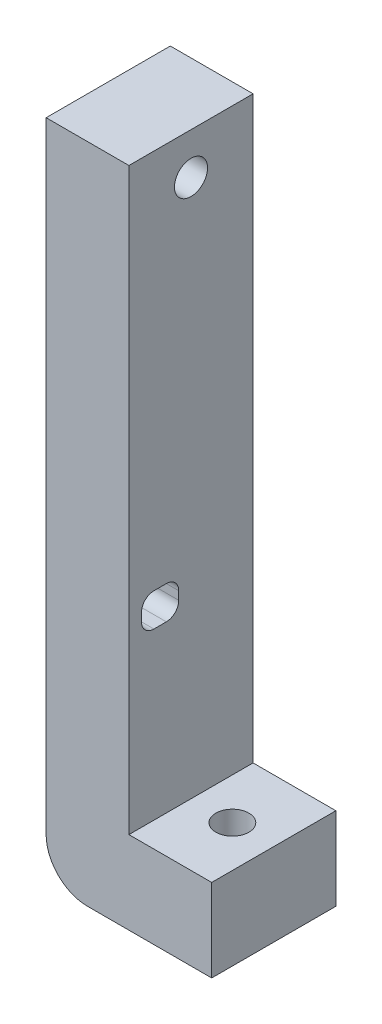
ISO-10303-21;
HEADER;
FILE_DESCRIPTION(('STEP AP214'),'2;1');
FILE_NAME('part.step','',(''),(''),'','','');
FILE_SCHEMA(('AUTOMOTIVE_DESIGN { 1 0 10303 214 1 1 1 1 }'));
ENDSEC;
DATA;
#1=APPLICATION_CONTEXT('core data for automotive mechanical design processes');
#2=APPLICATION_PROTOCOL_DEFINITION('international standard','automotive_design',2000,#1);
#3=PRODUCT_CONTEXT('',#1,'mechanical');
#4=PRODUCT('Part','Part','',(#3));
#5=PRODUCT_RELATED_PRODUCT_CATEGORY('part','',(#4));
#6=PRODUCT_DEFINITION_FORMATION('','',#4);
#7=PRODUCT_DEFINITION_CONTEXT('part definition',#1,'design');
#8=PRODUCT_DEFINITION('design','',#6,#7);
#9=PRODUCT_DEFINITION_SHAPE('','',#8);
#10=(LENGTH_UNIT() NAMED_UNIT(*) SI_UNIT(.MILLI.,.METRE.));
#11=(NAMED_UNIT(*) PLANE_ANGLE_UNIT() SI_UNIT($,.RADIAN.));
#12=(NAMED_UNIT(*) SI_UNIT($,.STERADIAN.) SOLID_ANGLE_UNIT());
#13=UNCERTAINTY_MEASURE_WITH_UNIT(LENGTH_MEASURE(1.E-05),#10,'distance_accuracy_value','');
#14=(GEOMETRIC_REPRESENTATION_CONTEXT(3) GLOBAL_UNCERTAINTY_ASSIGNED_CONTEXT((#13)) GLOBAL_UNIT_ASSIGNED_CONTEXT((#10,
#11,#12)) REPRESENTATION_CONTEXT('',''));
#15=CARTESIAN_POINT('',(0.,0.,0.));
#16=DIRECTION('',(0.,0.,1.));
#17=DIRECTION('',(1.,0.,0.));
#18=AXIS2_PLACEMENT_3D('',#15,#16,#17);
#19=CARTESIAN_POINT('',(-10.,-20.,15.));
#20=DIRECTION('',(1.,0.,0.));
#21=DIRECTION('',(0.,0.,-1.));
#22=AXIS2_PLACEMENT_3D('',#19,#20,#21);
#23=PLANE('',#22);
#24=CARTESIAN_POINT('',(-10.,55.,7.49999999999999));
#25=DIRECTION('',(-1.,0.,0.));
#26=DIRECTION('',(0.,0.,1.));
#27=AXIS2_PLACEMENT_3D('',#24,#25,#26);
#28=CIRCLE('',#27,2.);
#29=CARTESIAN_POINT('',(-10.,55.,9.49999999999999));
#30=VERTEX_POINT('',#29);
#31=EDGE_CURVE('E176',#30,#30,#28,.T.);
#32=ORIENTED_EDGE('',*,*,#31,.F.);
#33=EDGE_LOOP('',(#32));
#34=FACE_BOUND('',#33,.T.);
#35=DIRECTION('',(0.,0.,1.));
#36=VECTOR('',#35,1.);
#37=CARTESIAN_POINT('',(-10.,14.,11.98));
#38=LINE('',#37,#36);
#39=CARTESIAN_POINT('',(-10.,14.,10.48));
#40=VERTEX_POINT('',#39);
#41=CARTESIAN_POINT('',(-10.,14.,11.98));
#42=VERTEX_POINT('',#41);
#43=EDGE_CURVE('E160',#40,#42,#38,.T.);
#44=ORIENTED_EDGE('',*,*,#43,.T.);
#45=CARTESIAN_POINT('',(-10.,12.5,11.98));
#46=DIRECTION('',(1.,0.,0.));
#47=DIRECTION('',(0.,-1.,0.));
#48=AXIS2_PLACEMENT_3D('',#45,#46,#47);
#49=CIRCLE('',#48,1.5);
#50=CARTESIAN_POINT('',(-10.,12.5,13.48));
#51=VERTEX_POINT('',#50);
#52=EDGE_CURVE('E154',#42,#51,#49,.T.);
#53=ORIENTED_EDGE('',*,*,#52,.T.);
#54=DIRECTION('',(0.,-1.,0.));
#55=VECTOR('',#54,1.);
#56=CARTESIAN_POINT('',(-10.,11.5,13.48));
#57=LINE('',#56,#55);
#58=CARTESIAN_POINT('',(-10.,11.5,13.48));
#59=VERTEX_POINT('',#58);
#60=EDGE_CURVE('E163',#51,#59,#57,.T.);
#61=ORIENTED_EDGE('',*,*,#60,.T.);
#62=CARTESIAN_POINT('',(-10.,11.5,11.98));
#63=DIRECTION('',(1.,0.,0.));
#64=DIRECTION('',(0.,1.,0.));
#65=AXIS2_PLACEMENT_3D('',#62,#63,#64);
#66=CIRCLE('',#65,1.5);
#67=CARTESIAN_POINT('',(-10.,10.,11.98));
#68=VERTEX_POINT('',#67);
#69=EDGE_CURVE('E61',#59,#68,#66,.T.);
#70=ORIENTED_EDGE('',*,*,#69,.T.);
#71=DIRECTION('',(0.,0.,-1.));
#72=VECTOR('',#71,1.);
#73=CARTESIAN_POINT('',(-10.,10.,10.48));
#74=LINE('',#73,#72);
#75=CARTESIAN_POINT('',(-10.,10.,10.48));
#76=VERTEX_POINT('',#75);
#77=EDGE_CURVE('E179',#68,#76,#74,.T.);
#78=ORIENTED_EDGE('',*,*,#77,.T.);
#79=CARTESIAN_POINT('',(-10.,11.5,10.48));
#80=DIRECTION('',(1.,0.,0.));
#81=DIRECTION('',(0.,-1.,0.));
#82=AXIS2_PLACEMENT_3D('',#79,#80,#81);
#83=CIRCLE('',#82,1.5);
#84=CARTESIAN_POINT('',(-10.,11.5,8.98));
#85=VERTEX_POINT('',#84);
#86=EDGE_CURVE('E182',#76,#85,#83,.T.);
#87=ORIENTED_EDGE('',*,*,#86,.T.);
#88=DIRECTION('',(0.,1.,0.));
#89=VECTOR('',#88,1.);
#90=CARTESIAN_POINT('',(-10.,12.5,8.98));
#91=LINE('',#90,#89);
#92=CARTESIAN_POINT('',(-10.,12.5,8.98));
#93=VERTEX_POINT('',#92);
#94=EDGE_CURVE('E185',#85,#93,#91,.T.);
#95=ORIENTED_EDGE('',*,*,#94,.T.);
#96=CARTESIAN_POINT('',(-10.,12.5,10.48));
#97=DIRECTION('',(1.,0.,0.));
#98=DIRECTION('',(0.,-1.,0.));
#99=AXIS2_PLACEMENT_3D('',#96,#97,#98);
#100=CIRCLE('',#99,1.5);
#101=EDGE_CURVE('E188',#93,#40,#100,.T.);
#102=ORIENTED_EDGE('',*,*,#101,.T.);
#103=EDGE_LOOP('',(#44,#53,#61,#70,#78,#87,#95,#102));
#104=FACE_BOUND('',#103,.T.);
#105=DIRECTION('',(0.,-1.,0.));
#106=VECTOR('',#105,1.);
#107=CARTESIAN_POINT('',(-10.,-20.,0.));
#108=LINE('',#107,#106);
#109=CARTESIAN_POINT('',(-10.,60.,0.));
#110=VERTEX_POINT('',#109);
#111=CARTESIAN_POINT('',(-10.,-15.,0.));
#112=VERTEX_POINT('',#111);
#113=EDGE_CURVE('E237',#110,#112,#108,.T.);
#114=ORIENTED_EDGE('',*,*,#113,.T.);
#115=DIRECTION('',(0.,0.,-1.));
#116=VECTOR('',#115,1.);
#117=CARTESIAN_POINT('',(-10.,-15.,15.));
#118=LINE('',#117,#116);
#119=CARTESIAN_POINT('',(-10.,-15.,15.));
#120=VERTEX_POINT('',#119);
#121=EDGE_CURVE('E53',#112,#120,#118,.F.);
#122=ORIENTED_EDGE('',*,*,#121,.T.);
#123=DIRECTION('',(0.,-1.,0.));
#124=VECTOR('',#123,1.);
#125=CARTESIAN_POINT('',(-10.,-20.,15.));
#126=LINE('',#125,#124);
#127=CARTESIAN_POINT('',(-10.,60.,15.));
#128=VERTEX_POINT('',#127);
#129=EDGE_CURVE('E238',#128,#120,#126,.T.);
#130=ORIENTED_EDGE('',*,*,#129,.F.);
#131=DIRECTION('',(0.,0.,1.));
#132=VECTOR('',#131,1.);
#133=CARTESIAN_POINT('',(-10.,60.,0.));
#134=LINE('',#133,#132);
#135=EDGE_CURVE('E231',#110,#128,#134,.T.);
#136=ORIENTED_EDGE('',*,*,#135,.F.);
#137=EDGE_LOOP('',(#114,#122,#130,#136));
#138=FACE_BOUND('',#137,.T.);
#139=ADVANCED_FACE('F44',(#34,#104,#138),#23,.F.);
#140=CARTESIAN_POINT('',(-10.,-20.,15.));
#141=DIRECTION('',(0.,1.,0.));
#142=DIRECTION('',(0.,0.,1.));
#143=AXIS2_PLACEMENT_3D('',#140,#141,#142);
#144=PLANE('',#143);
#145=CARTESIAN_POINT('',(5.,-20.,7.5));
#146=DIRECTION('',(0.,-1.,0.));
#147=DIRECTION('',(0.,0.,-1.));
#148=AXIS2_PLACEMENT_3D('',#145,#146,#147);
#149=CIRCLE('',#148,2.);
#150=CARTESIAN_POINT('',(5.,-20.,5.5));
#151=VERTEX_POINT('',#150);
#152=EDGE_CURVE('E210',#151,#151,#149,.T.);
#153=ORIENTED_EDGE('',*,*,#152,.F.);
#154=EDGE_LOOP('',(#153));
#155=FACE_BOUND('',#154,.T.);
#156=DIRECTION('',(1.,0.,0.));
#157=VECTOR('',#156,1.);
#158=CARTESIAN_POINT('',(-10.,-20.,15.));
#159=LINE('',#158,#157);
#160=CARTESIAN_POINT('',(-5.,-20.,15.));
#161=VERTEX_POINT('',#160);
#162=CARTESIAN_POINT('',(10.,-20.,15.));
#163=VERTEX_POINT('',#162);
#164=EDGE_CURVE('E241',#161,#163,#159,.T.);
#165=ORIENTED_EDGE('',*,*,#164,.F.);
#166=DIRECTION('',(0.,0.,-1.));
#167=VECTOR('',#166,1.);
#168=CARTESIAN_POINT('',(-5.,-20.,15.));
#169=LINE('',#168,#167);
#170=CARTESIAN_POINT('',(-5.,-20.,0.));
#171=VERTEX_POINT('',#170);
#172=EDGE_CURVE('E268',#161,#171,#169,.T.);
#173=ORIENTED_EDGE('',*,*,#172,.T.);
#174=DIRECTION('',(1.,0.,0.));
#175=VECTOR('',#174,1.);
#176=CARTESIAN_POINT('',(-10.,-20.,0.));
#177=LINE('',#176,#175);
#178=CARTESIAN_POINT('',(10.,-20.,0.));
#179=VERTEX_POINT('',#178);
#180=EDGE_CURVE('E253',#171,#179,#177,.T.);
#181=ORIENTED_EDGE('',*,*,#180,.T.);
#182=DIRECTION('',(0.,0.,-1.));
#183=VECTOR('',#182,1.);
#184=CARTESIAN_POINT('',(10.,-20.,15.));
#185=LINE('',#184,#183);
#186=EDGE_CURVE('E265',#163,#179,#185,.T.);
#187=ORIENTED_EDGE('',*,*,#186,.F.);
#188=EDGE_LOOP('',(#165,#173,#181,#187));
#189=FACE_BOUND('',#188,.T.);
#190=ADVANCED_FACE('F293',(#155,#189),#144,.F.);
#191=CARTESIAN_POINT('',(10.,-20.,15.));
#192=DIRECTION('',(-1.,0.,0.));
#193=DIRECTION('',(0.,-1.,0.));
#194=AXIS2_PLACEMENT_3D('',#191,#192,#193);
#195=PLANE('',#194);
#196=DIRECTION('',(0.,1.,0.));
#197=VECTOR('',#196,1.);
#198=CARTESIAN_POINT('',(10.,-20.,0.));
#199=LINE('',#198,#197);
#200=CARTESIAN_POINT('',(10.,-10.,0.));
#201=VERTEX_POINT('',#200);
#202=EDGE_CURVE('E255',#179,#201,#199,.T.);
#203=ORIENTED_EDGE('',*,*,#202,.T.);
#204=DIRECTION('',(0.,0.,-1.));
#205=VECTOR('',#204,1.);
#206=CARTESIAN_POINT('',(10.,-10.,15.));
#207=LINE('',#206,#205);
#208=CARTESIAN_POINT('',(10.,-10.,15.));
#209=VERTEX_POINT('',#208);
#210=EDGE_CURVE('E262',#209,#201,#207,.T.);
#211=ORIENTED_EDGE('',*,*,#210,.F.);
#212=DIRECTION('',(0.,1.,0.));
#213=VECTOR('',#212,1.);
#214=CARTESIAN_POINT('',(10.,-20.,15.));
#215=LINE('',#214,#213);
#216=EDGE_CURVE('E244',#163,#209,#215,.T.);
#217=ORIENTED_EDGE('',*,*,#216,.F.);
#218=ORIENTED_EDGE('',*,*,#186,.T.);
#219=EDGE_LOOP('',(#203,#211,#217,#218));
#220=FACE_BOUND('',#219,.T.);
#221=ADVANCED_FACE('F298',(#220),#195,.F.);
#222=CARTESIAN_POINT('',(0.,-10.,15.));
#223=DIRECTION('',(0.,-1.,0.));
#224=DIRECTION('',(0.,0.,-1.));
#225=AXIS2_PLACEMENT_3D('',#222,#223,#224);
#226=PLANE('',#225);
#227=CARTESIAN_POINT('',(5.,-9.99999999999999,7.5));
#228=DIRECTION('',(0.,-1.,0.));
#229=DIRECTION('',(0.,0.,-1.));
#230=AXIS2_PLACEMENT_3D('',#227,#228,#229);
#231=CIRCLE('',#230,2.);
#232=CARTESIAN_POINT('',(5.,-9.99999999999999,5.5));
#233=VERTEX_POINT('',#232);
#234=EDGE_CURVE('E224',#233,#233,#231,.T.);
#235=ORIENTED_EDGE('',*,*,#234,.T.);
#236=EDGE_LOOP('',(#235));
#237=FACE_BOUND('',#236,.T.);
#238=DIRECTION('',(-1.,0.,0.));
#239=VECTOR('',#238,1.);
#240=CARTESIAN_POINT('',(0.,-10.,0.));
#241=LINE('',#240,#239);
#242=CARTESIAN_POINT('',(0.,-10.,0.));
#243=VERTEX_POINT('',#242);
#244=EDGE_CURVE('E257',#201,#243,#241,.T.);
#245=ORIENTED_EDGE('',*,*,#244,.T.);
#246=DIRECTION('',(0.,0.,-1.));
#247=VECTOR('',#246,1.);
#248=CARTESIAN_POINT('',(0.,-10.,15.));
#249=LINE('',#248,#247);
#250=CARTESIAN_POINT('',(0.,-10.,15.));
#251=VERTEX_POINT('',#250);
#252=EDGE_CURVE('E250',#251,#243,#249,.T.);
#253=ORIENTED_EDGE('',*,*,#252,.F.);
#254=DIRECTION('',(-1.,0.,0.));
#255=VECTOR('',#254,1.);
#256=CARTESIAN_POINT('',(0.,-10.,15.));
#257=LINE('',#256,#255);
#258=EDGE_CURVE('E246',#209,#251,#257,.T.);
#259=ORIENTED_EDGE('',*,*,#258,.F.);
#260=ORIENTED_EDGE('',*,*,#210,.T.);
#261=EDGE_LOOP('',(#245,#253,#259,#260));
#262=FACE_BOUND('',#261,.T.);
#263=ADVANCED_FACE('F276',(#237,#262),#226,.F.);
#264=CARTESIAN_POINT('',(0.,20.,15.));
#265=DIRECTION('',(-1.,0.,0.));
#266=DIRECTION('',(0.,-1.,0.));
#267=AXIS2_PLACEMENT_3D('',#264,#265,#266);
#268=PLANE('',#267);
#269=CARTESIAN_POINT('',(0.,55.,7.49999999999999));
#270=DIRECTION('',(-1.,0.,0.));
#271=DIRECTION('',(0.,-1.,0.));
#272=AXIS2_PLACEMENT_3D('',#269,#270,#271);
#273=CIRCLE('',#272,2.);
#274=CARTESIAN_POINT('',(0.,53.,7.49999999999999));
#275=VERTEX_POINT('',#274);
#276=EDGE_CURVE('E48',#275,#275,#273,.T.);
#277=ORIENTED_EDGE('',*,*,#276,.T.);
#278=EDGE_LOOP('',(#277));
#279=FACE_BOUND('',#278,.T.);
#280=DIRECTION('',(0.,-1.,0.));
#281=VECTOR('',#280,1.);
#282=CARTESIAN_POINT('',(0.,11.5,13.48));
#283=LINE('',#282,#281);
#284=CARTESIAN_POINT('',(0.,12.5,13.48));
#285=VERTEX_POINT('',#284);
#286=CARTESIAN_POINT('',(0.,11.5,13.48));
#287=VERTEX_POINT('',#286);
#288=EDGE_CURVE('E192',#285,#287,#283,.T.);
#289=ORIENTED_EDGE('',*,*,#288,.F.);
#290=CARTESIAN_POINT('',(0.,12.5,11.98));
#291=DIRECTION('',(1.,0.,0.));
#292=DIRECTION('',(0.,-1.,0.));
#293=AXIS2_PLACEMENT_3D('',#290,#291,#292);
#294=CIRCLE('',#293,1.5);
#295=CARTESIAN_POINT('',(0.,14.,11.98));
#296=VERTEX_POINT('',#295);
#297=EDGE_CURVE('E69',#296,#285,#294,.T.);
#298=ORIENTED_EDGE('',*,*,#297,.F.);
#299=DIRECTION('',(0.,0.,1.));
#300=VECTOR('',#299,1.);
#301=CARTESIAN_POINT('',(0.,14.,11.98));
#302=LINE('',#301,#300);
#303=CARTESIAN_POINT('',(0.,14.,10.48));
#304=VERTEX_POINT('',#303);
#305=EDGE_CURVE('E170',#304,#296,#302,.T.);
#306=ORIENTED_EDGE('',*,*,#305,.F.);
#307=CARTESIAN_POINT('',(0.,12.5,10.48));
#308=DIRECTION('',(1.,0.,0.));
#309=DIRECTION('',(0.,-1.,0.));
#310=AXIS2_PLACEMENT_3D('',#307,#308,#309);
#311=CIRCLE('',#310,1.5);
#312=CARTESIAN_POINT('',(0.,12.5,8.98));
#313=VERTEX_POINT('',#312);
#314=EDGE_CURVE('E173',#313,#304,#311,.T.);
#315=ORIENTED_EDGE('',*,*,#314,.F.);
#316=DIRECTION('',(0.,1.,0.));
#317=VECTOR('',#316,1.);
#318=CARTESIAN_POINT('',(0.,12.5,8.98));
#319=LINE('',#318,#317);
#320=CARTESIAN_POINT('',(0.,11.5,8.98));
#321=VERTEX_POINT('',#320);
#322=EDGE_CURVE('E203',#321,#313,#319,.T.);
#323=ORIENTED_EDGE('',*,*,#322,.F.);
#324=CARTESIAN_POINT('',(0.,11.5,10.48));
#325=DIRECTION('',(1.,0.,0.));
#326=DIRECTION('',(0.,-1.,0.));
#327=AXIS2_PLACEMENT_3D('',#324,#325,#326);
#328=CIRCLE('',#327,1.5);
#329=CARTESIAN_POINT('',(0.,10.,10.48));
#330=VERTEX_POINT('',#329);
#331=EDGE_CURVE('E200',#330,#321,#328,.T.);
#332=ORIENTED_EDGE('',*,*,#331,.F.);
#333=DIRECTION('',(0.,0.,-1.));
#334=VECTOR('',#333,1.);
#335=CARTESIAN_POINT('',(0.,10.,10.48));
#336=LINE('',#335,#334);
#337=CARTESIAN_POINT('',(0.,10.,11.98));
#338=VERTEX_POINT('',#337);
#339=EDGE_CURVE('E197',#338,#330,#336,.T.);
#340=ORIENTED_EDGE('',*,*,#339,.F.);
#341=CARTESIAN_POINT('',(0.,11.5,11.98));
#342=DIRECTION('',(1.,0.,0.));
#343=DIRECTION('',(0.,1.,0.));
#344=AXIS2_PLACEMENT_3D('',#341,#342,#343);
#345=CIRCLE('',#344,1.5);
#346=EDGE_CURVE('E194',#287,#338,#345,.T.);
#347=ORIENTED_EDGE('',*,*,#346,.F.);
#348=EDGE_LOOP('',(#289,#298,#306,#315,#323,#332,#340,#347));
#349=FACE_BOUND('',#348,.T.);
#350=DIRECTION('',(0.,1.,0.));
#351=VECTOR('',#350,1.);
#352=CARTESIAN_POINT('',(0.,20.,0.));
#353=LINE('',#352,#351);
#354=CARTESIAN_POINT('',(0.,60.,0.));
#355=VERTEX_POINT('',#354);
#356=EDGE_CURVE('E242',#243,#355,#353,.T.);
#357=ORIENTED_EDGE('',*,*,#356,.T.);
#358=DIRECTION('',(0.,0.,-1.));
#359=VECTOR('',#358,1.);
#360=CARTESIAN_POINT('',(0.,60.,15.));
#361=LINE('',#360,#359);
#362=CARTESIAN_POINT('',(0.,60.,15.));
#363=VERTEX_POINT('',#362);
#364=EDGE_CURVE('E225',#363,#355,#361,.T.);
#365=ORIENTED_EDGE('',*,*,#364,.F.);
#366=DIRECTION('',(0.,1.,0.));
#367=VECTOR('',#366,1.);
#368=CARTESIAN_POINT('',(0.,20.,15.));
#369=LINE('',#368,#367);
#370=EDGE_CURVE('E248',#251,#363,#369,.T.);
#371=ORIENTED_EDGE('',*,*,#370,.F.);
#372=ORIENTED_EDGE('',*,*,#252,.T.);
#373=EDGE_LOOP('',(#357,#365,#371,#372));
#374=FACE_BOUND('',#373,.T.);
#375=ADVANCED_FACE('F308',(#279,#349,#374),#268,.F.);
#376=CARTESIAN_POINT('',(0.,0.,15.));
#377=DIRECTION('',(0.,0.,-1.));
#378=DIRECTION('',(-1.,0.,0.));
#379=AXIS2_PLACEMENT_3D('',#376,#377,#378);
#380=PLANE('',#379);
#381=ORIENTED_EDGE('',*,*,#129,.T.);
#382=CARTESIAN_POINT('',(-5.,-15.,15.));
#383=DIRECTION('',(0.,0.,-1.));
#384=DIRECTION('',(-1.,0.,0.));
#385=AXIS2_PLACEMENT_3D('',#382,#383,#384);
#386=CIRCLE('',#385,5.);
#387=EDGE_CURVE('E13',#120,#161,#386,.F.);
#388=ORIENTED_EDGE('',*,*,#387,.T.);
#389=ORIENTED_EDGE('',*,*,#164,.T.);
#390=ORIENTED_EDGE('',*,*,#216,.T.);
#391=ORIENTED_EDGE('',*,*,#258,.T.);
#392=ORIENTED_EDGE('',*,*,#370,.T.);
#393=DIRECTION('',(1.,0.,0.));
#394=VECTOR('',#393,1.);
#395=CARTESIAN_POINT('',(-10.,60.,15.));
#396=LINE('',#395,#394);
#397=EDGE_CURVE('E234',#128,#363,#396,.T.);
#398=ORIENTED_EDGE('',*,*,#397,.F.);
#399=EDGE_LOOP('',(#381,#388,#389,#390,#391,#392,#398));
#400=FACE_BOUND('',#399,.T.);
#401=ADVANCED_FACE('F311',(#400),#380,.F.);
#402=CARTESIAN_POINT('',(0.,0.,0.));
#403=DIRECTION('',(0.,0.,-1.));
#404=DIRECTION('',(-1.,0.,0.));
#405=AXIS2_PLACEMENT_3D('',#402,#403,#404);
#406=PLANE('',#405);
#407=ORIENTED_EDGE('',*,*,#180,.F.);
#408=CARTESIAN_POINT('',(-5.,-15.,0.));
#409=DIRECTION('',(0.,0.,-1.));
#410=DIRECTION('',(-1.,0.,0.));
#411=AXIS2_PLACEMENT_3D('',#408,#409,#410);
#412=CIRCLE('',#411,5.);
#413=EDGE_CURVE('E271',#171,#112,#412,.T.);
#414=ORIENTED_EDGE('',*,*,#413,.T.);
#415=ORIENTED_EDGE('',*,*,#113,.F.);
#416=DIRECTION('',(-1.,0.,0.));
#417=VECTOR('',#416,1.);
#418=CARTESIAN_POINT('',(0.,60.,0.));
#419=LINE('',#418,#417);
#420=EDGE_CURVE('E228',#355,#110,#419,.T.);
#421=ORIENTED_EDGE('',*,*,#420,.F.);
#422=ORIENTED_EDGE('',*,*,#356,.F.);
#423=ORIENTED_EDGE('',*,*,#244,.F.);
#424=ORIENTED_EDGE('',*,*,#202,.F.);
#425=EDGE_LOOP('',(#407,#414,#415,#421,#422,#423,#424));
#426=FACE_BOUND('',#425,.T.);
#427=ADVANCED_FACE('F313',(#426),#406,.T.);
#428=CARTESIAN_POINT('',(-5.,-15.,15.));
#429=DIRECTION('',(0.,0.,-1.));
#430=DIRECTION('',(-1.,0.,0.));
#431=AXIS2_PLACEMENT_3D('',#428,#429,#430);
#432=CYLINDRICAL_SURFACE('',#431,5.);
#433=ORIENTED_EDGE('',*,*,#387,.F.);
#434=ORIENTED_EDGE('',*,*,#121,.F.);
#435=ORIENTED_EDGE('',*,*,#413,.F.);
#436=ORIENTED_EDGE('',*,*,#172,.F.);
#437=EDGE_LOOP('',(#433,#434,#435,#436));
#438=FACE_BOUND('',#437,.T.);
#439=ADVANCED_FACE('F46',(#438),#432,.T.);
#440=CARTESIAN_POINT('',(0.,60.,0.));
#441=DIRECTION('',(0.,1.,0.));
#442=DIRECTION('',(0.,0.,1.));
#443=AXIS2_PLACEMENT_3D('',#440,#441,#442);
#444=PLANE('',#443);
#445=ORIENTED_EDGE('',*,*,#364,.T.);
#446=ORIENTED_EDGE('',*,*,#420,.T.);
#447=ORIENTED_EDGE('',*,*,#135,.T.);
#448=ORIENTED_EDGE('',*,*,#397,.T.);
#449=EDGE_LOOP('',(#445,#446,#447,#448));
#450=FACE_BOUND('',#449,.T.);
#451=ADVANCED_FACE('F281',(#450),#444,.T.);
#452=CARTESIAN_POINT('',(5.,60.,7.5));
#453=DIRECTION('',(0.,-1.,0.));
#454=DIRECTION('',(0.,0.,-1.));
#455=AXIS2_PLACEMENT_3D('',#452,#453,#454);
#456=CYLINDRICAL_SURFACE('',#455,2.);
#457=ORIENTED_EDGE('',*,*,#152,.T.);
#458=EDGE_LOOP('',(#457));
#459=FACE_BOUND('',#458,.T.);
#460=ORIENTED_EDGE('',*,*,#234,.F.);
#461=EDGE_LOOP('',(#460));
#462=FACE_BOUND('',#461,.T.);
#463=ADVANCED_FACE('F279',(#459,#462),#456,.F.);
#464=CARTESIAN_POINT('',(-10.,12.5,11.98));
#465=DIRECTION('',(1.,0.,0.));
#466=DIRECTION('',(0.,1.,0.));
#467=AXIS2_PLACEMENT_3D('',#464,#465,#466);
#468=CYLINDRICAL_SURFACE('',#467,1.5);
#469=ORIENTED_EDGE('',*,*,#297,.T.);
#470=DIRECTION('',(1.,0.,0.));
#471=VECTOR('',#470,1.);
#472=CARTESIAN_POINT('',(-10.,12.5,13.48));
#473=LINE('',#472,#471);
#474=EDGE_CURVE('E150',#51,#285,#473,.T.);
#475=ORIENTED_EDGE('',*,*,#474,.F.);
#476=ORIENTED_EDGE('',*,*,#52,.F.);
#477=DIRECTION('',(1.,0.,0.));
#478=VECTOR('',#477,1.);
#479=CARTESIAN_POINT('',(-10.,14.,11.98));
#480=LINE('',#479,#478);
#481=EDGE_CURVE('E208',#42,#296,#480,.T.);
#482=ORIENTED_EDGE('',*,*,#481,.T.);
#483=EDGE_LOOP('',(#469,#475,#476,#482));
#484=FACE_BOUND('',#483,.T.);
#485=ADVANCED_FACE('F152',(#484),#468,.F.);
#486=CARTESIAN_POINT('',(-10.,14.,11.98));
#487=DIRECTION('',(0.,1.,0.));
#488=DIRECTION('',(-1.,0.,0.));
#489=AXIS2_PLACEMENT_3D('',#486,#487,#488);
#490=PLANE('',#489);
#491=ORIENTED_EDGE('',*,*,#305,.T.);
#492=ORIENTED_EDGE('',*,*,#481,.F.);
#493=ORIENTED_EDGE('',*,*,#43,.F.);
#494=DIRECTION('',(1.,0.,0.));
#495=VECTOR('',#494,1.);
#496=CARTESIAN_POINT('',(-10.,14.,10.48));
#497=LINE('',#496,#495);
#498=EDGE_CURVE('E211',#40,#304,#497,.T.);
#499=ORIENTED_EDGE('',*,*,#498,.T.);
#500=EDGE_LOOP('',(#491,#492,#493,#499));
#501=FACE_BOUND('',#500,.T.);
#502=ADVANCED_FACE('F288',(#501),#490,.F.);
#503=CARTESIAN_POINT('',(-10.,12.5,10.48));
#504=DIRECTION('',(1.,0.,0.));
#505=DIRECTION('',(0.,1.,0.));
#506=AXIS2_PLACEMENT_3D('',#503,#504,#505);
#507=CYLINDRICAL_SURFACE('',#506,1.5);
#508=ORIENTED_EDGE('',*,*,#314,.T.);
#509=ORIENTED_EDGE('',*,*,#498,.F.);
#510=ORIENTED_EDGE('',*,*,#101,.F.);
#511=DIRECTION('',(1.,0.,0.));
#512=VECTOR('',#511,1.);
#513=CARTESIAN_POINT('',(-10.,12.5,8.98));
#514=LINE('',#513,#512);
#515=EDGE_CURVE('E213',#93,#313,#514,.T.);
#516=ORIENTED_EDGE('',*,*,#515,.T.);
#517=EDGE_LOOP('',(#508,#509,#510,#516));
#518=FACE_BOUND('',#517,.T.);
#519=ADVANCED_FACE('F388',(#518),#507,.F.);
#520=CARTESIAN_POINT('',(-10.,12.5,8.98));
#521=DIRECTION('',(0.,0.,-1.));
#522=DIRECTION('',(-1.,0.,0.));
#523=AXIS2_PLACEMENT_3D('',#520,#521,#522);
#524=PLANE('',#523);
#525=ORIENTED_EDGE('',*,*,#322,.T.);
#526=ORIENTED_EDGE('',*,*,#515,.F.);
#527=ORIENTED_EDGE('',*,*,#94,.F.);
#528=DIRECTION('',(1.,0.,0.));
#529=VECTOR('',#528,1.);
#530=CARTESIAN_POINT('',(-10.,11.5,8.98));
#531=LINE('',#530,#529);
#532=EDGE_CURVE('E215',#85,#321,#531,.T.);
#533=ORIENTED_EDGE('',*,*,#532,.T.);
#534=EDGE_LOOP('',(#525,#526,#527,#533));
#535=FACE_BOUND('',#534,.T.);
#536=ADVANCED_FACE('F398',(#535),#524,.F.);
#537=CARTESIAN_POINT('',(-10.,11.5,10.48));
#538=DIRECTION('',(1.,0.,0.));
#539=DIRECTION('',(0.,1.,0.));
#540=AXIS2_PLACEMENT_3D('',#537,#538,#539);
#541=CYLINDRICAL_SURFACE('',#540,1.5);
#542=ORIENTED_EDGE('',*,*,#331,.T.);
#543=ORIENTED_EDGE('',*,*,#532,.F.);
#544=ORIENTED_EDGE('',*,*,#86,.F.);
#545=DIRECTION('',(1.,0.,0.));
#546=VECTOR('',#545,1.);
#547=CARTESIAN_POINT('',(-10.,10.,10.48));
#548=LINE('',#547,#546);
#549=EDGE_CURVE('E217',#76,#330,#548,.T.);
#550=ORIENTED_EDGE('',*,*,#549,.T.);
#551=EDGE_LOOP('',(#542,#543,#544,#550));
#552=FACE_BOUND('',#551,.T.);
#553=ADVANCED_FACE('F408',(#552),#541,.F.);
#554=CARTESIAN_POINT('',(-10.,10.,10.48));
#555=DIRECTION('',(0.,-1.,0.));
#556=DIRECTION('',(1.,0.,0.));
#557=AXIS2_PLACEMENT_3D('',#554,#555,#556);
#558=PLANE('',#557);
#559=ORIENTED_EDGE('',*,*,#339,.T.);
#560=ORIENTED_EDGE('',*,*,#549,.F.);
#561=ORIENTED_EDGE('',*,*,#77,.F.);
#562=DIRECTION('',(1.,0.,0.));
#563=VECTOR('',#562,1.);
#564=CARTESIAN_POINT('',(-10.,10.,11.98));
#565=LINE('',#564,#563);
#566=EDGE_CURVE('E219',#68,#338,#565,.T.);
#567=ORIENTED_EDGE('',*,*,#566,.T.);
#568=EDGE_LOOP('',(#559,#560,#561,#567));
#569=FACE_BOUND('',#568,.T.);
#570=ADVANCED_FACE('F418',(#569),#558,.F.);
#571=CARTESIAN_POINT('',(-10.,11.5,11.98));
#572=DIRECTION('',(1.,0.,0.));
#573=DIRECTION('',(0.,1.,0.));
#574=AXIS2_PLACEMENT_3D('',#571,#572,#573);
#575=CYLINDRICAL_SURFACE('',#574,1.5);
#576=ORIENTED_EDGE('',*,*,#346,.T.);
#577=ORIENTED_EDGE('',*,*,#566,.F.);
#578=ORIENTED_EDGE('',*,*,#69,.F.);
#579=DIRECTION('',(1.,0.,0.));
#580=VECTOR('',#579,1.);
#581=CARTESIAN_POINT('',(-10.,11.5,13.48));
#582=LINE('',#581,#580);
#583=EDGE_CURVE('E159',#59,#287,#582,.T.);
#584=ORIENTED_EDGE('',*,*,#583,.T.);
#585=EDGE_LOOP('',(#576,#577,#578,#584));
#586=FACE_BOUND('',#585,.T.);
#587=ADVANCED_FACE('F428',(#586),#575,.F.);
#588=CARTESIAN_POINT('',(-10.,11.5,13.48));
#589=DIRECTION('',(0.,0.,1.));
#590=DIRECTION('',(1.,0.,0.));
#591=AXIS2_PLACEMENT_3D('',#588,#589,#590);
#592=PLANE('',#591);
#593=ORIENTED_EDGE('',*,*,#288,.T.);
#594=ORIENTED_EDGE('',*,*,#583,.F.);
#595=ORIENTED_EDGE('',*,*,#60,.F.);
#596=ORIENTED_EDGE('',*,*,#474,.T.);
#597=EDGE_LOOP('',(#593,#594,#595,#596));
#598=FACE_BOUND('',#597,.T.);
#599=ADVANCED_FACE('F164',(#598),#592,.F.);
#600=CARTESIAN_POINT('',(10.,55.,7.49999999999999));
#601=DIRECTION('',(-1.,0.,0.));
#602=DIRECTION('',(0.,0.,1.));
#603=AXIS2_PLACEMENT_3D('',#600,#601,#602);
#604=CYLINDRICAL_SURFACE('',#603,2.);
#605=ORIENTED_EDGE('',*,*,#31,.T.);
#606=EDGE_LOOP('',(#605));
#607=FACE_BOUND('',#606,.T.);
#608=ORIENTED_EDGE('',*,*,#276,.F.);
#609=EDGE_LOOP('',(#608));
#610=FACE_BOUND('',#609,.T.);
#611=ADVANCED_FACE('F445',(#607,#610),#604,.F.);
#612=CLOSED_SHELL('',(#139,#190,#221,#263,#375,#401,#427,#439,#451,#463,#485,#502,#519,#536,
#553,#570,#587,#599,#611));
#613=MANIFOLD_SOLID_BREP('B2',#612);
#614=ADVANCED_BREP_SHAPE_REPRESENTATION('',(#18,#613),#14);
#615=SHAPE_DEFINITION_REPRESENTATION(#9,#614);
ENDSEC;
END-ISO-10303-21;
